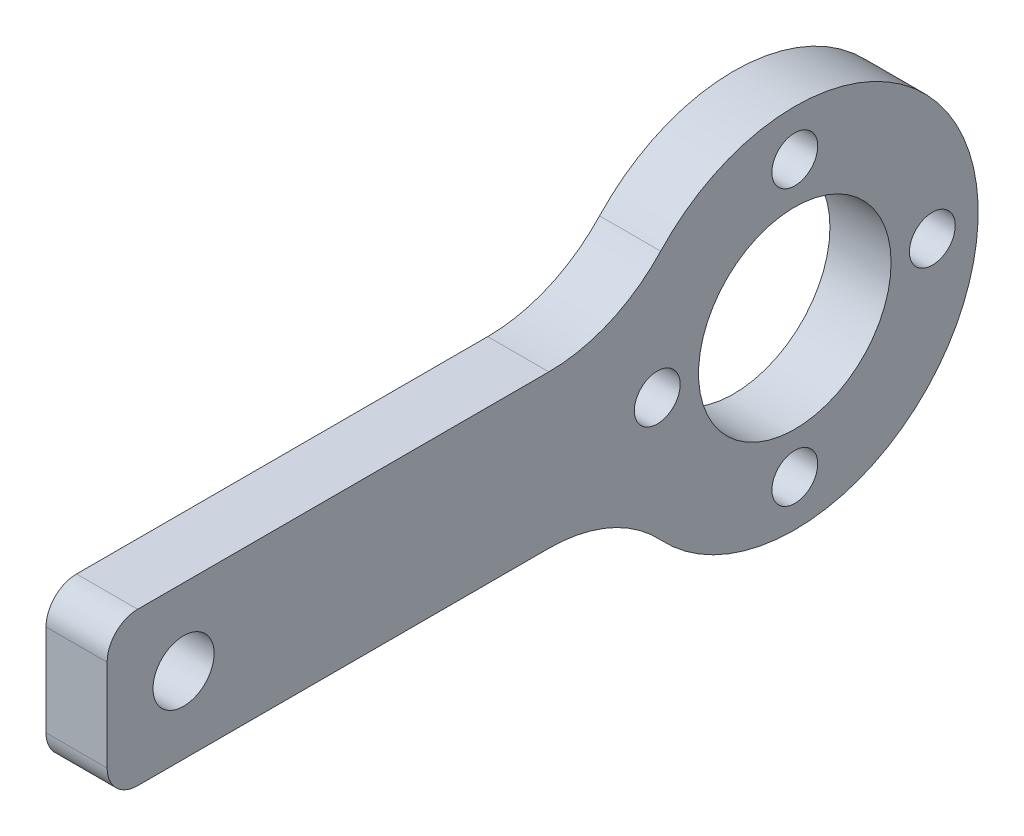
ISO-10303-21;
HEADER;
FILE_DESCRIPTION(('STEP AP214'),'2;1');
FILE_NAME('part.step','',(''),(''),'','','');
FILE_SCHEMA(('AUTOMOTIVE_DESIGN { 1 0 10303 214 1 1 1 1 }'));
ENDSEC;
DATA;
#1=APPLICATION_CONTEXT('core data for automotive mechanical design processes');
#2=APPLICATION_PROTOCOL_DEFINITION('international standard','automotive_design',2000,#1);
#3=PRODUCT_CONTEXT('',#1,'mechanical');
#4=PRODUCT('Part','Part','',(#3));
#5=PRODUCT_RELATED_PRODUCT_CATEGORY('part','',(#4));
#6=PRODUCT_DEFINITION_FORMATION('','',#4);
#7=PRODUCT_DEFINITION_CONTEXT('part definition',#1,'design');
#8=PRODUCT_DEFINITION('design','',#6,#7);
#9=PRODUCT_DEFINITION_SHAPE('','',#8);
#10=(LENGTH_UNIT() NAMED_UNIT(*) SI_UNIT(.MILLI.,.METRE.));
#11=(NAMED_UNIT(*) PLANE_ANGLE_UNIT() SI_UNIT($,.RADIAN.));
#12=(NAMED_UNIT(*) SI_UNIT($,.STERADIAN.) SOLID_ANGLE_UNIT());
#13=UNCERTAINTY_MEASURE_WITH_UNIT(LENGTH_MEASURE(1.E-05),#10,'distance_accuracy_value','');
#14=(GEOMETRIC_REPRESENTATION_CONTEXT(3) GLOBAL_UNCERTAINTY_ASSIGNED_CONTEXT((#13)) GLOBAL_UNIT_ASSIGNED_CONTEXT((#10,
#11,#12)) REPRESENTATION_CONTEXT('',''));
#15=CARTESIAN_POINT('',(0.,0.,0.));
#16=DIRECTION('',(0.,0.,1.));
#17=DIRECTION('',(1.,0.,0.));
#18=AXIS2_PLACEMENT_3D('',#15,#16,#17);
#19=CARTESIAN_POINT('',(4.,0.,0.));
#20=DIRECTION('',(1.,0.,0.));
#21=DIRECTION('',(0.,0.,-1.));
#22=AXIS2_PLACEMENT_3D('',#19,#20,#21);
#23=PLANE('',#22);
#24=CARTESIAN_POINT('',(4.,0.,0.));
#25=DIRECTION('',(1.,0.,0.));
#26=DIRECTION('',(0.,0.,-1.));
#27=AXIS2_PLACEMENT_3D('',#24,#25,#26);
#28=CIRCLE('',#27,6.3);
#29=CARTESIAN_POINT('',(4.,0.,-6.3));
#30=VERTEX_POINT('',#29);
#31=EDGE_CURVE('E198',#30,#30,#28,.T.);
#32=ORIENTED_EDGE('',*,*,#31,.F.);
#33=EDGE_LOOP('',(#32));
#34=FACE_BOUND('',#33,.T.);
#35=DIRECTION('',(0.,-1.,0.));
#36=VECTOR('',#35,1.);
#37=CARTESIAN_POINT('',(4.,-5.,45.));
#38=LINE('',#37,#36);
#39=CARTESIAN_POINT('',(4.,3.,45.));
#40=VERTEX_POINT('',#39);
#41=CARTESIAN_POINT('',(4.,-3.,45.));
#42=VERTEX_POINT('',#41);
#43=EDGE_CURVE('E168',#40,#42,#38,.T.);
#44=ORIENTED_EDGE('',*,*,#43,.T.);
#45=CARTESIAN_POINT('',(4.,-3.,43.));
#46=DIRECTION('',(1.,0.,0.));
#47=DIRECTION('',(0.,0.,-1.));
#48=AXIS2_PLACEMENT_3D('',#45,#46,#47);
#49=CIRCLE('',#48,2.);
#50=CARTESIAN_POINT('',(4.,-5.,43.));
#51=VERTEX_POINT('',#50);
#52=EDGE_CURVE('E150',#42,#51,#49,.T.);
#53=ORIENTED_EDGE('',*,*,#52,.T.);
#54=DIRECTION('',(0.,0.,-1.));
#55=VECTOR('',#54,1.);
#56=CARTESIAN_POINT('',(4.,-5.,45.));
#57=LINE('',#56,#55);
#58=CARTESIAN_POINT('',(4.,-5.,16.0934769394311));
#59=VERTEX_POINT('',#58);
#60=EDGE_CURVE('E110',#51,#59,#57,.T.);
#61=ORIENTED_EDGE('',*,*,#60,.T.);
#62=CARTESIAN_POINT('',(4.,-15.,16.0934769394311));
#63=DIRECTION('',(1.,0.,0.));
#64=DIRECTION('',(0.,0.,-1.));
#65=AXIS2_PLACEMENT_3D('',#62,#63,#64);
#66=CIRCLE('',#65,10.);
#67=CARTESIAN_POINT('',(4.,-8.18181818181818,8.77826014878059));
#68=VERTEX_POINT('',#67);
#69=EDGE_CURVE('E105',#59,#68,#66,.F.);
#70=ORIENTED_EDGE('',*,*,#69,.T.);
#71=CARTESIAN_POINT('',(4.,0.,0.));
#72=DIRECTION('',(1.,0.,0.));
#73=DIRECTION('',(0.,0.,-1.));
#74=AXIS2_PLACEMENT_3D('',#71,#72,#73);
#75=CIRCLE('',#74,12.);
#76=CARTESIAN_POINT('',(4.,8.18181818181818,8.77826014878059));
#77=VERTEX_POINT('',#76);
#78=EDGE_CURVE('E109',#68,#77,#75,.T.);
#79=ORIENTED_EDGE('',*,*,#78,.T.);
#80=CARTESIAN_POINT('',(4.,15.,16.0934769394311));
#81=DIRECTION('',(1.,0.,0.));
#82=DIRECTION('',(0.,0.,-1.));
#83=AXIS2_PLACEMENT_3D('',#80,#81,#82);
#84=CIRCLE('',#83,10.);
#85=CARTESIAN_POINT('',(4.,5.,16.0934769394311));
#86=VERTEX_POINT('',#85);
#87=EDGE_CURVE('E115',#77,#86,#84,.F.);
#88=ORIENTED_EDGE('',*,*,#87,.T.);
#89=DIRECTION('',(0.,0.,1.));
#90=VECTOR('',#89,1.);
#91=CARTESIAN_POINT('',(4.,5.,45.));
#92=LINE('',#91,#90);
#93=CARTESIAN_POINT('',(4.,5.,43.));
#94=VERTEX_POINT('',#93);
#95=EDGE_CURVE('E170',#86,#94,#92,.T.);
#96=ORIENTED_EDGE('',*,*,#95,.T.);
#97=CARTESIAN_POINT('',(4.,3.,43.));
#98=DIRECTION('',(1.,0.,0.));
#99=DIRECTION('',(0.,0.,-1.));
#100=AXIS2_PLACEMENT_3D('',#97,#98,#99);
#101=CIRCLE('',#100,2.);
#102=EDGE_CURVE('E148',#94,#40,#101,.T.);
#103=ORIENTED_EDGE('',*,*,#102,.T.);
#104=EDGE_LOOP('',(#44,#53,#61,#70,#79,#88,#96,#103));
#105=FACE_BOUND('',#104,.T.);
#106=CARTESIAN_POINT('',(4.,-9.,1.8995222061946E-13));
#107=DIRECTION('',(1.,0.,0.));
#108=DIRECTION('',(0.,0.,-1.));
#109=AXIS2_PLACEMENT_3D('',#106,#107,#108);
#110=CIRCLE('',#109,1.5);
#111=CARTESIAN_POINT('',(4.,-9.,-1.49999999999981));
#112=VERTEX_POINT('',#111);
#113=EDGE_CURVE('E186',#112,#112,#110,.T.);
#114=ORIENTED_EDGE('',*,*,#113,.F.);
#115=EDGE_LOOP('',(#114));
#116=FACE_BOUND('',#115,.T.);
#117=CARTESIAN_POINT('',(4.,9.,0.));
#118=DIRECTION('',(1.,0.,0.));
#119=DIRECTION('',(0.,0.,-1.));
#120=AXIS2_PLACEMENT_3D('',#117,#118,#119);
#121=CIRCLE('',#120,1.5);
#122=CARTESIAN_POINT('',(4.,9.,-1.5));
#123=VERTEX_POINT('',#122);
#124=EDGE_CURVE('E204',#123,#123,#121,.T.);
#125=ORIENTED_EDGE('',*,*,#124,.F.);
#126=EDGE_LOOP('',(#125));
#127=FACE_BOUND('',#126,.T.);
#128=CARTESIAN_POINT('',(4.,-1.61329283265843E-13,-9.));
#129=DIRECTION('',(1.,0.,0.));
#130=DIRECTION('',(0.,0.,-1.));
#131=AXIS2_PLACEMENT_3D('',#128,#129,#130);
#132=CIRCLE('',#131,1.5);
#133=CARTESIAN_POINT('',(4.,-1.61329283265843E-13,-10.5));
#134=VERTEX_POINT('',#133);
#135=EDGE_CURVE('E192',#134,#134,#132,.T.);
#136=ORIENTED_EDGE('',*,*,#135,.F.);
#137=EDGE_LOOP('',(#136));
#138=FACE_BOUND('',#137,.T.);
#139=CARTESIAN_POINT('',(4.,2.21610924056037E-13,9.));
#140=DIRECTION('',(1.,0.,0.));
#141=DIRECTION('',(0.,0.,-1.));
#142=AXIS2_PLACEMENT_3D('',#139,#140,#141);
#143=CIRCLE('',#142,1.5);
#144=CARTESIAN_POINT('',(4.,2.21610924056037E-13,7.5));
#145=VERTEX_POINT('',#144);
#146=EDGE_CURVE('E178',#145,#145,#143,.T.);
#147=ORIENTED_EDGE('',*,*,#146,.F.);
#148=EDGE_LOOP('',(#147));
#149=FACE_BOUND('',#148,.T.);
#150=CARTESIAN_POINT('',(4.,0.,40.));
#151=DIRECTION('',(1.,0.,0.));
#152=DIRECTION('',(0.,0.,-1.));
#153=AXIS2_PLACEMENT_3D('',#150,#151,#152);
#154=CIRCLE('',#153,2.);
#155=CARTESIAN_POINT('',(4.,0.,38.));
#156=VERTEX_POINT('',#155);
#157=EDGE_CURVE('E174',#156,#156,#154,.T.);
#158=ORIENTED_EDGE('',*,*,#157,.F.);
#159=EDGE_LOOP('',(#158));
#160=FACE_BOUND('',#159,.T.);
#161=ADVANCED_FACE('F37',(#34,#105,#116,#127,#138,#149,#160),#23,.T.);
#162=CARTESIAN_POINT('',(0.,0.,0.));
#163=DIRECTION('',(1.,0.,0.));
#164=DIRECTION('',(0.,0.,-1.));
#165=AXIS2_PLACEMENT_3D('',#162,#163,#164);
#166=PLANE('',#165);
#167=CARTESIAN_POINT('',(0.,0.,0.));
#168=DIRECTION('',(1.,0.,0.));
#169=DIRECTION('',(0.,0.,-1.));
#170=AXIS2_PLACEMENT_3D('',#167,#168,#169);
#171=CIRCLE('',#170,6.3);
#172=CARTESIAN_POINT('',(0.,0.,-6.3));
#173=VERTEX_POINT('',#172);
#174=EDGE_CURVE('E195',#173,#173,#171,.T.);
#175=ORIENTED_EDGE('',*,*,#174,.T.);
#176=EDGE_LOOP('',(#175));
#177=FACE_BOUND('',#176,.T.);
#178=CARTESIAN_POINT('',(0.,9.,0.));
#179=DIRECTION('',(1.,0.,0.));
#180=DIRECTION('',(0.,0.,-1.));
#181=AXIS2_PLACEMENT_3D('',#178,#179,#180);
#182=CIRCLE('',#181,1.5);
#183=CARTESIAN_POINT('',(0.,9.,-1.5));
#184=VERTEX_POINT('',#183);
#185=EDGE_CURVE('E201',#184,#184,#182,.T.);
#186=ORIENTED_EDGE('',*,*,#185,.T.);
#187=EDGE_LOOP('',(#186));
#188=FACE_BOUND('',#187,.T.);
#189=DIRECTION('',(0.,0.,1.));
#190=VECTOR('',#189,1.);
#191=CARTESIAN_POINT('',(0.,-5.,45.));
#192=LINE('',#191,#190);
#193=CARTESIAN_POINT('',(0.,-5.,16.0934769394311));
#194=VERTEX_POINT('',#193);
#195=CARTESIAN_POINT('',(0.,-5.,43.));
#196=VERTEX_POINT('',#195);
#197=EDGE_CURVE('E158',#194,#196,#192,.T.);
#198=ORIENTED_EDGE('',*,*,#197,.T.);
#199=CARTESIAN_POINT('',(0.,-3.,43.));
#200=DIRECTION('',(1.,0.,0.));
#201=DIRECTION('',(0.,0.,-1.));
#202=AXIS2_PLACEMENT_3D('',#199,#200,#201);
#203=CIRCLE('',#202,2.);
#204=CARTESIAN_POINT('',(0.,-3.,45.));
#205=VERTEX_POINT('',#204);
#206=EDGE_CURVE('E45',#196,#205,#203,.F.);
#207=ORIENTED_EDGE('',*,*,#206,.T.);
#208=DIRECTION('',(0.,1.,0.));
#209=VECTOR('',#208,1.);
#210=CARTESIAN_POINT('',(0.,-5.,45.));
#211=LINE('',#210,#209);
#212=CARTESIAN_POINT('',(0.,3.,45.));
#213=VERTEX_POINT('',#212);
#214=EDGE_CURVE('E157',#205,#213,#211,.T.);
#215=ORIENTED_EDGE('',*,*,#214,.T.);
#216=CARTESIAN_POINT('',(0.,3.,43.));
#217=DIRECTION('',(1.,0.,0.));
#218=DIRECTION('',(0.,0.,-1.));
#219=AXIS2_PLACEMENT_3D('',#216,#217,#218);
#220=CIRCLE('',#219,2.);
#221=CARTESIAN_POINT('',(0.,5.,43.));
#222=VERTEX_POINT('',#221);
#223=EDGE_CURVE('E52',#213,#222,#220,.F.);
#224=ORIENTED_EDGE('',*,*,#223,.T.);
#225=DIRECTION('',(0.,0.,-1.));
#226=VECTOR('',#225,1.);
#227=CARTESIAN_POINT('',(0.,5.,45.));
#228=LINE('',#227,#226);
#229=CARTESIAN_POINT('',(0.,5.,16.0934769394311));
#230=VERTEX_POINT('',#229);
#231=EDGE_CURVE('E165',#222,#230,#228,.T.);
#232=ORIENTED_EDGE('',*,*,#231,.T.);
#233=CARTESIAN_POINT('',(0.,15.,16.0934769394311));
#234=DIRECTION('',(1.,0.,0.));
#235=DIRECTION('',(0.,0.,-1.));
#236=AXIS2_PLACEMENT_3D('',#233,#234,#235);
#237=CIRCLE('',#236,10.);
#238=CARTESIAN_POINT('',(0.,8.18181818181818,8.77826014878059));
#239=VERTEX_POINT('',#238);
#240=EDGE_CURVE('E141',#230,#239,#237,.T.);
#241=ORIENTED_EDGE('',*,*,#240,.T.);
#242=CARTESIAN_POINT('',(0.,0.,0.));
#243=DIRECTION('',(1.,0.,0.));
#244=DIRECTION('',(0.,0.,-1.));
#245=AXIS2_PLACEMENT_3D('',#242,#243,#244);
#246=CIRCLE('',#245,12.);
#247=CARTESIAN_POINT('',(0.,-8.18181818181818,8.77826014878059));
#248=VERTEX_POINT('',#247);
#249=EDGE_CURVE('E127',#248,#239,#246,.T.);
#250=ORIENTED_EDGE('',*,*,#249,.F.);
#251=CARTESIAN_POINT('',(0.,-15.,16.0934769394311));
#252=DIRECTION('',(1.,0.,0.));
#253=DIRECTION('',(0.,0.,-1.));
#254=AXIS2_PLACEMENT_3D('',#251,#252,#253);
#255=CIRCLE('',#254,10.);
#256=EDGE_CURVE('E116',#248,#194,#255,.T.);
#257=ORIENTED_EDGE('',*,*,#256,.T.);
#258=EDGE_LOOP('',(#198,#207,#215,#224,#232,#241,#250,#257));
#259=FACE_BOUND('',#258,.T.);
#260=CARTESIAN_POINT('',(0.,-1.61329283265843E-13,-9.));
#261=DIRECTION('',(1.,0.,0.));
#262=DIRECTION('',(0.,0.,-1.));
#263=AXIS2_PLACEMENT_3D('',#260,#261,#262);
#264=CIRCLE('',#263,1.5);
#265=CARTESIAN_POINT('',(0.,-1.61329283265843E-13,-10.5));
#266=VERTEX_POINT('',#265);
#267=EDGE_CURVE('E189',#266,#266,#264,.T.);
#268=ORIENTED_EDGE('',*,*,#267,.T.);
#269=EDGE_LOOP('',(#268));
#270=FACE_BOUND('',#269,.T.);
#271=CARTESIAN_POINT('',(0.,-9.,1.8995222061946E-13));
#272=DIRECTION('',(1.,0.,0.));
#273=DIRECTION('',(0.,0.,-1.));
#274=AXIS2_PLACEMENT_3D('',#271,#272,#273);
#275=CIRCLE('',#274,1.5);
#276=CARTESIAN_POINT('',(0.,-9.,-1.49999999999981));
#277=VERTEX_POINT('',#276);
#278=EDGE_CURVE('E181',#277,#277,#275,.T.);
#279=ORIENTED_EDGE('',*,*,#278,.T.);
#280=EDGE_LOOP('',(#279));
#281=FACE_BOUND('',#280,.T.);
#282=CARTESIAN_POINT('',(0.,2.21610924056037E-13,9.));
#283=DIRECTION('',(1.,0.,0.));
#284=DIRECTION('',(0.,0.,-1.));
#285=AXIS2_PLACEMENT_3D('',#282,#283,#284);
#286=CIRCLE('',#285,1.5);
#287=CARTESIAN_POINT('',(0.,2.21610924056037E-13,7.5));
#288=VERTEX_POINT('',#287);
#289=EDGE_CURVE('E182',#288,#288,#286,.T.);
#290=ORIENTED_EDGE('',*,*,#289,.T.);
#291=EDGE_LOOP('',(#290));
#292=FACE_BOUND('',#291,.T.);
#293=CARTESIAN_POINT('',(0.,0.,40.));
#294=DIRECTION('',(1.,0.,0.));
#295=DIRECTION('',(0.,0.,-1.));
#296=AXIS2_PLACEMENT_3D('',#293,#294,#295);
#297=CIRCLE('',#296,2.);
#298=CARTESIAN_POINT('',(0.,0.,38.));
#299=VERTEX_POINT('',#298);
#300=EDGE_CURVE('E185',#299,#299,#297,.F.);
#301=ORIENTED_EDGE('',*,*,#300,.F.);
#302=EDGE_LOOP('',(#301));
#303=FACE_BOUND('',#302,.T.);
#304=ADVANCED_FACE('F155',(#177,#188,#259,#270,#281,#292,#303),#166,.F.);
#305=CARTESIAN_POINT('',(4.,0.,0.));
#306=DIRECTION('',(-1.,0.,0.));
#307=DIRECTION('',(0.,0.,1.));
#308=AXIS2_PLACEMENT_3D('',#305,#306,#307);
#309=CYLINDRICAL_SURFACE('',#308,12.);
#310=ORIENTED_EDGE('',*,*,#78,.F.);
#311=DIRECTION('',(-1.,0.,0.));
#312=VECTOR('',#311,1.);
#313=CARTESIAN_POINT('',(4.,-8.18181818181818,8.77826014878059));
#314=LINE('',#313,#312);
#315=EDGE_CURVE('E123',#68,#248,#314,.T.);
#316=ORIENTED_EDGE('',*,*,#315,.T.);
#317=ORIENTED_EDGE('',*,*,#249,.T.);
#318=DIRECTION('',(-1.,0.,0.));
#319=VECTOR('',#318,1.);
#320=CARTESIAN_POINT('',(4.,8.18181818181818,8.77826014878059));
#321=LINE('',#320,#319);
#322=EDGE_CURVE('E126',#239,#77,#321,.F.);
#323=ORIENTED_EDGE('',*,*,#322,.T.);
#324=EDGE_LOOP('',(#310,#316,#317,#323));
#325=FACE_BOUND('',#324,.T.);
#326=ADVANCED_FACE('F121',(#325),#309,.T.);
#327=CARTESIAN_POINT('',(4.,9.,0.));
#328=DIRECTION('',(-1.,0.,0.));
#329=DIRECTION('',(0.,0.,1.));
#330=AXIS2_PLACEMENT_3D('',#327,#328,#329);
#331=CYLINDRICAL_SURFACE('',#330,1.5);
#332=ORIENTED_EDGE('',*,*,#124,.T.);
#333=EDGE_LOOP('',(#332));
#334=FACE_BOUND('',#333,.T.);
#335=ORIENTED_EDGE('',*,*,#185,.F.);
#336=EDGE_LOOP('',(#335));
#337=FACE_BOUND('',#336,.T.);
#338=ADVANCED_FACE('F231',(#334,#337),#331,.F.);
#339=CARTESIAN_POINT('',(4.,0.,0.));
#340=DIRECTION('',(-1.,0.,0.));
#341=DIRECTION('',(0.,0.,1.));
#342=AXIS2_PLACEMENT_3D('',#339,#340,#341);
#343=CYLINDRICAL_SURFACE('',#342,6.3);
#344=ORIENTED_EDGE('',*,*,#31,.T.);
#345=EDGE_LOOP('',(#344));
#346=FACE_BOUND('',#345,.T.);
#347=ORIENTED_EDGE('',*,*,#174,.F.);
#348=EDGE_LOOP('',(#347));
#349=FACE_BOUND('',#348,.T.);
#350=ADVANCED_FACE('F279',(#346,#349),#343,.F.);
#351=CARTESIAN_POINT('',(4.,-1.61329283265843E-13,-9.));
#352=DIRECTION('',(-1.,0.,0.));
#353=DIRECTION('',(0.,0.,1.));
#354=AXIS2_PLACEMENT_3D('',#351,#352,#353);
#355=CYLINDRICAL_SURFACE('',#354,1.5);
#356=ORIENTED_EDGE('',*,*,#135,.T.);
#357=EDGE_LOOP('',(#356));
#358=FACE_BOUND('',#357,.T.);
#359=ORIENTED_EDGE('',*,*,#267,.F.);
#360=EDGE_LOOP('',(#359));
#361=FACE_BOUND('',#360,.T.);
#362=ADVANCED_FACE('F282',(#358,#361),#355,.F.);
#363=CARTESIAN_POINT('',(4.,-9.,1.8995222061946E-13));
#364=DIRECTION('',(-1.,0.,0.));
#365=DIRECTION('',(0.,0.,1.));
#366=AXIS2_PLACEMENT_3D('',#363,#364,#365);
#367=CYLINDRICAL_SURFACE('',#366,1.5);
#368=ORIENTED_EDGE('',*,*,#113,.T.);
#369=EDGE_LOOP('',(#368));
#370=FACE_BOUND('',#369,.T.);
#371=ORIENTED_EDGE('',*,*,#278,.F.);
#372=EDGE_LOOP('',(#371));
#373=FACE_BOUND('',#372,.T.);
#374=ADVANCED_FACE('F295',(#370,#373),#367,.F.);
#375=CARTESIAN_POINT('',(4.,2.21610924056037E-13,9.));
#376=DIRECTION('',(-1.,0.,0.));
#377=DIRECTION('',(0.,0.,1.));
#378=AXIS2_PLACEMENT_3D('',#375,#376,#377);
#379=CYLINDRICAL_SURFACE('',#378,1.5);
#380=ORIENTED_EDGE('',*,*,#146,.T.);
#381=EDGE_LOOP('',(#380));
#382=FACE_BOUND('',#381,.T.);
#383=ORIENTED_EDGE('',*,*,#289,.F.);
#384=EDGE_LOOP('',(#383));
#385=FACE_BOUND('',#384,.T.);
#386=ADVANCED_FACE('F303',(#382,#385),#379,.F.);
#387=CARTESIAN_POINT('',(-41.2310562561766,-5.,45.));
#388=DIRECTION('',(0.,-1.,0.));
#389=DIRECTION('',(0.,0.,-1.));
#390=AXIS2_PLACEMENT_3D('',#387,#388,#389);
#391=PLANE('',#390);
#392=ORIENTED_EDGE('',*,*,#60,.F.);
#393=DIRECTION('',(1.,0.,0.));
#394=VECTOR('',#393,1.);
#395=CARTESIAN_POINT('',(-41.2310562561766,-5.,43.));
#396=LINE('',#395,#394);
#397=EDGE_CURVE('E60',#51,#196,#396,.F.);
#398=ORIENTED_EDGE('',*,*,#397,.T.);
#399=ORIENTED_EDGE('',*,*,#197,.F.);
#400=DIRECTION('',(-1.,0.,0.));
#401=VECTOR('',#400,1.);
#402=CARTESIAN_POINT('',(-41.2310562561766,-5.,16.0934769394311));
#403=LINE('',#402,#401);
#404=EDGE_CURVE('E130',#194,#59,#403,.F.);
#405=ORIENTED_EDGE('',*,*,#404,.T.);
#406=EDGE_LOOP('',(#392,#398,#399,#405));
#407=FACE_BOUND('',#406,.T.);
#408=ADVANCED_FACE('F169',(#407),#391,.T.);
#409=CARTESIAN_POINT('',(-41.2310562561766,5.,45.));
#410=DIRECTION('',(0.,1.,0.));
#411=DIRECTION('',(0.,0.,1.));
#412=AXIS2_PLACEMENT_3D('',#409,#410,#411);
#413=PLANE('',#412);
#414=ORIENTED_EDGE('',*,*,#231,.F.);
#415=DIRECTION('',(1.,0.,0.));
#416=VECTOR('',#415,1.);
#417=CARTESIAN_POINT('',(-41.2310562561766,5.,43.));
#418=LINE('',#417,#416);
#419=EDGE_CURVE('E11',#222,#94,#418,.T.);
#420=ORIENTED_EDGE('',*,*,#419,.T.);
#421=ORIENTED_EDGE('',*,*,#95,.F.);
#422=DIRECTION('',(-1.,0.,0.));
#423=VECTOR('',#422,1.);
#424=CARTESIAN_POINT('',(-41.2310562561766,5.,16.0934769394311));
#425=LINE('',#424,#423);
#426=EDGE_CURVE('E132',#86,#230,#425,.T.);
#427=ORIENTED_EDGE('',*,*,#426,.T.);
#428=EDGE_LOOP('',(#414,#420,#421,#427));
#429=FACE_BOUND('',#428,.T.);
#430=ADVANCED_FACE('F214',(#429),#413,.T.);
#431=CARTESIAN_POINT('',(-41.2310562561766,-5.,45.));
#432=DIRECTION('',(0.,0.,1.));
#433=DIRECTION('',(1.,0.,0.));
#434=AXIS2_PLACEMENT_3D('',#431,#432,#433);
#435=PLANE('',#434);
#436=ORIENTED_EDGE('',*,*,#214,.F.);
#437=DIRECTION('',(1.,0.,0.));
#438=VECTOR('',#437,1.);
#439=CARTESIAN_POINT('',(-41.2310562561766,-3.,45.));
#440=LINE('',#439,#438);
#441=EDGE_CURVE('E145',#205,#42,#440,.T.);
#442=ORIENTED_EDGE('',*,*,#441,.T.);
#443=ORIENTED_EDGE('',*,*,#43,.F.);
#444=DIRECTION('',(1.,0.,0.));
#445=VECTOR('',#444,1.);
#446=CARTESIAN_POINT('',(-41.2310562561766,3.,45.));
#447=LINE('',#446,#445);
#448=EDGE_CURVE('E143',#40,#213,#447,.F.);
#449=ORIENTED_EDGE('',*,*,#448,.T.);
#450=EDGE_LOOP('',(#436,#442,#443,#449));
#451=FACE_BOUND('',#450,.T.);
#452=ADVANCED_FACE('F162',(#451),#435,.T.);
#453=CARTESIAN_POINT('',(-41.2310562561766,0.,40.));
#454=DIRECTION('',(1.,0.,0.));
#455=DIRECTION('',(0.,0.,-1.));
#456=AXIS2_PLACEMENT_3D('',#453,#454,#455);
#457=CYLINDRICAL_SURFACE('',#456,2.);
#458=ORIENTED_EDGE('',*,*,#300,.T.);
#459=EDGE_LOOP('',(#458));
#460=FACE_BOUND('',#459,.T.);
#461=ORIENTED_EDGE('',*,*,#157,.T.);
#462=EDGE_LOOP('',(#461));
#463=FACE_BOUND('',#462,.T.);
#464=ADVANCED_FACE('F238',(#460,#463),#457,.F.);
#465=CARTESIAN_POINT('',(4.,-15.,16.0934769394311));
#466=DIRECTION('',(-1.,0.,0.));
#467=DIRECTION('',(0.,0.,1.));
#468=AXIS2_PLACEMENT_3D('',#465,#466,#467);
#469=CYLINDRICAL_SURFACE('',#468,10.);
#470=ORIENTED_EDGE('',*,*,#69,.F.);
#471=ORIENTED_EDGE('',*,*,#404,.F.);
#472=ORIENTED_EDGE('',*,*,#256,.F.);
#473=ORIENTED_EDGE('',*,*,#315,.F.);
#474=EDGE_LOOP('',(#470,#471,#472,#473));
#475=FACE_BOUND('',#474,.T.);
#476=ADVANCED_FACE('F129',(#475),#469,.F.);
#477=CARTESIAN_POINT('',(4.,15.,16.0934769394311));
#478=DIRECTION('',(-1.,0.,0.));
#479=DIRECTION('',(0.,0.,1.));
#480=AXIS2_PLACEMENT_3D('',#477,#478,#479);
#481=CYLINDRICAL_SURFACE('',#480,10.);
#482=ORIENTED_EDGE('',*,*,#240,.F.);
#483=ORIENTED_EDGE('',*,*,#426,.F.);
#484=ORIENTED_EDGE('',*,*,#87,.F.);
#485=ORIENTED_EDGE('',*,*,#322,.F.);
#486=EDGE_LOOP('',(#482,#483,#484,#485));
#487=FACE_BOUND('',#486,.T.);
#488=ADVANCED_FACE('F210',(#487),#481,.F.);
#489=CARTESIAN_POINT('',(-41.2310562561766,-3.,43.));
#490=DIRECTION('',(1.,0.,0.));
#491=DIRECTION('',(0.,0.,-1.));
#492=AXIS2_PLACEMENT_3D('',#489,#490,#491);
#493=CYLINDRICAL_SURFACE('',#492,2.);
#494=ORIENTED_EDGE('',*,*,#206,.F.);
#495=ORIENTED_EDGE('',*,*,#397,.F.);
#496=ORIENTED_EDGE('',*,*,#52,.F.);
#497=ORIENTED_EDGE('',*,*,#441,.F.);
#498=EDGE_LOOP('',(#494,#495,#496,#497));
#499=FACE_BOUND('',#498,.T.);
#500=ADVANCED_FACE('F167',(#499),#493,.T.);
#501=CARTESIAN_POINT('',(-41.2310562561766,3.,43.));
#502=DIRECTION('',(1.,0.,0.));
#503=DIRECTION('',(0.,0.,-1.));
#504=AXIS2_PLACEMENT_3D('',#501,#502,#503);
#505=CYLINDRICAL_SURFACE('',#504,2.);
#506=ORIENTED_EDGE('',*,*,#223,.F.);
#507=ORIENTED_EDGE('',*,*,#448,.F.);
#508=ORIENTED_EDGE('',*,*,#102,.F.);
#509=ORIENTED_EDGE('',*,*,#419,.F.);
#510=EDGE_LOOP('',(#506,#507,#508,#509));
#511=FACE_BOUND('',#510,.T.);
#512=ADVANCED_FACE('F39',(#511),#505,.T.);
#513=CLOSED_SHELL('',(#161,#304,#326,#338,#350,#362,#374,#386,#408,#430,#452,#464,#476,#488,
#500,#512));
#514=MANIFOLD_SOLID_BREP('B2',#513);
#515=ADVANCED_BREP_SHAPE_REPRESENTATION('',(#18,#514),#14);
#516=SHAPE_DEFINITION_REPRESENTATION(#9,#515);
ENDSEC;
END-ISO-10303-21;
